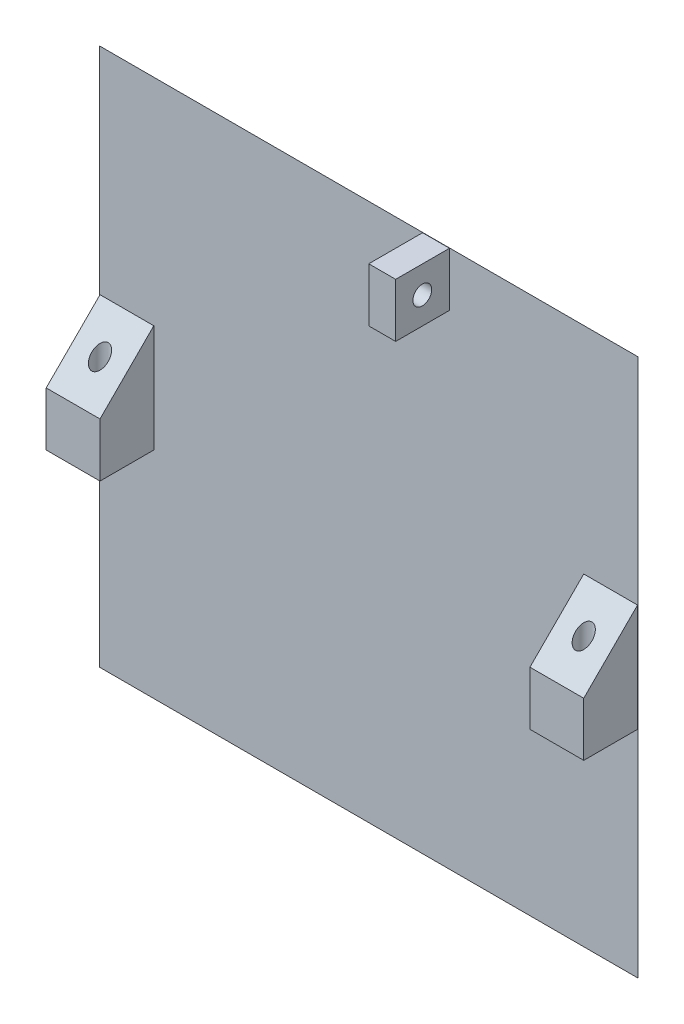
ISO-10303-21;
HEADER;
FILE_DESCRIPTION(('STEP AP214'),'2;1');
FILE_NAME('part.step','',(''),(''),'','','');
FILE_SCHEMA(('AUTOMOTIVE_DESIGN { 1 0 10303 214 1 1 1 1 }'));
ENDSEC;
DATA;
#1=APPLICATION_CONTEXT('core data for automotive mechanical design processes');
#2=APPLICATION_PROTOCOL_DEFINITION('international standard','automotive_design',2000,#1);
#3=PRODUCT_CONTEXT('',#1,'mechanical');
#4=PRODUCT('Part','Part','',(#3));
#5=PRODUCT_RELATED_PRODUCT_CATEGORY('part','',(#4));
#6=PRODUCT_DEFINITION_FORMATION('','',#4);
#7=PRODUCT_DEFINITION_CONTEXT('part definition',#1,'design');
#8=PRODUCT_DEFINITION('design','',#6,#7);
#9=PRODUCT_DEFINITION_SHAPE('','',#8);
#10=(LENGTH_UNIT() NAMED_UNIT(*) SI_UNIT(.MILLI.,.METRE.));
#11=(NAMED_UNIT(*) PLANE_ANGLE_UNIT() SI_UNIT($,.RADIAN.));
#12=(NAMED_UNIT(*) SI_UNIT($,.STERADIAN.) SOLID_ANGLE_UNIT());
#13=UNCERTAINTY_MEASURE_WITH_UNIT(LENGTH_MEASURE(1.E-05),#10,'distance_accuracy_value','');
#14=(GEOMETRIC_REPRESENTATION_CONTEXT(3) GLOBAL_UNCERTAINTY_ASSIGNED_CONTEXT((#13)) GLOBAL_UNIT_ASSIGNED_CONTEXT((#10,
#11,#12)) REPRESENTATION_CONTEXT('',''));
#15=CARTESIAN_POINT('',(0.,0.,0.));
#16=DIRECTION('',(0.,0.,1.));
#17=DIRECTION('',(1.,0.,0.));
#18=AXIS2_PLACEMENT_3D('',#15,#16,#17);
#19=CARTESIAN_POINT('',(0.,0.,3.));
#20=DIRECTION('',(0.,0.,1.));
#21=DIRECTION('',(1.,0.,0.));
#22=AXIS2_PLACEMENT_3D('',#19,#20,#21);
#23=PLANE('',#22);
#24=DIRECTION('',(1.,0.,0.));
#25=VECTOR('',#24,1.);
#26=CARTESIAN_POINT('',(89.95,40.,3.));
#27=LINE('',#26,#25);
#28=CARTESIAN_POINT('',(89.95,40.,3.));
#29=VERTEX_POINT('',#28);
#30=CARTESIAN_POINT('',(99.95,40.,3.));
#31=VERTEX_POINT('',#30);
#32=EDGE_CURVE('E202',#29,#31,#27,.T.);
#33=ORIENTED_EDGE('',*,*,#32,.F.);
#34=DIRECTION('',(0.,-1.,0.));
#35=VECTOR('',#34,1.);
#36=CARTESIAN_POINT('',(89.95,60.,3.));
#37=LINE('',#36,#35);
#38=CARTESIAN_POINT('',(89.95,60.,3.));
#39=VERTEX_POINT('',#38);
#40=EDGE_CURVE('E199',#39,#29,#37,.T.);
#41=ORIENTED_EDGE('',*,*,#40,.F.);
#42=DIRECTION('',(-1.,0.,0.));
#43=VECTOR('',#42,1.);
#44=CARTESIAN_POINT('',(89.95,60.,3.));
#45=LINE('',#44,#43);
#46=CARTESIAN_POINT('',(99.95,60.,3.));
#47=VERTEX_POINT('',#46);
#48=EDGE_CURVE('E193',#47,#39,#45,.T.);
#49=ORIENTED_EDGE('',*,*,#48,.F.);
#50=DIRECTION('',(0.,1.,0.));
#51=VECTOR('',#50,1.);
#52=CARTESIAN_POINT('',(99.95,60.,3.));
#53=LINE('',#52,#51);
#54=EDGE_CURVE('E204',#31,#47,#53,.T.);
#55=ORIENTED_EDGE('',*,*,#54,.F.);
#56=EDGE_LOOP('',(#33,#41,#49,#55));
#57=FACE_BOUND('',#56,.T.);
#58=DIRECTION('',(0.,-1.,0.));
#59=VECTOR('',#58,1.);
#60=CARTESIAN_POINT('',(0.,100.,3.));
#61=LINE('',#60,#59);
#62=CARTESIAN_POINT('',(0.,100.,3.));
#63=VERTEX_POINT('',#62);
#64=CARTESIAN_POINT('',(0.,0.,3.));
#65=VERTEX_POINT('',#64);
#66=EDGE_CURVE('E234',#63,#65,#61,.T.);
#67=ORIENTED_EDGE('',*,*,#66,.T.);
#68=DIRECTION('',(1.,0.,0.));
#69=VECTOR('',#68,1.);
#70=CARTESIAN_POINT('',(0.,0.,3.));
#71=LINE('',#70,#69);
#72=CARTESIAN_POINT('',(100.,0.,3.));
#73=VERTEX_POINT('',#72);
#74=EDGE_CURVE('E236',#65,#73,#71,.T.);
#75=ORIENTED_EDGE('',*,*,#74,.T.);
#76=DIRECTION('',(0.,1.,0.));
#77=VECTOR('',#76,1.);
#78=CARTESIAN_POINT('',(100.,100.,3.));
#79=LINE('',#78,#77);
#80=CARTESIAN_POINT('',(100.,100.,3.));
#81=VERTEX_POINT('',#80);
#82=EDGE_CURVE('E239',#73,#81,#79,.T.);
#83=ORIENTED_EDGE('',*,*,#82,.T.);
#84=DIRECTION('',(-1.,0.,0.));
#85=VECTOR('',#84,1.);
#86=CARTESIAN_POINT('',(0.,100.,3.));
#87=LINE('',#86,#85);
#88=EDGE_CURVE('E241',#81,#63,#87,.T.);
#89=ORIENTED_EDGE('',*,*,#88,.T.);
#90=EDGE_LOOP('',(#67,#75,#83,#89));
#91=FACE_BOUND('',#90,.T.);
#92=DIRECTION('',(1.,0.,0.));
#93=VECTOR('',#92,1.);
#94=CARTESIAN_POINT('',(0.0499999999999819,40.,3.));
#95=LINE('',#94,#93);
#96=CARTESIAN_POINT('',(0.0499999999999819,40.,3.));
#97=VERTEX_POINT('',#96);
#98=CARTESIAN_POINT('',(10.05,40.,3.));
#99=VERTEX_POINT('',#98);
#100=EDGE_CURVE('E224',#97,#99,#95,.T.);
#101=ORIENTED_EDGE('',*,*,#100,.F.);
#102=DIRECTION('',(0.,-1.,0.));
#103=VECTOR('',#102,1.);
#104=CARTESIAN_POINT('',(0.0499999999999793,60.,3.));
#105=LINE('',#104,#103);
#106=CARTESIAN_POINT('',(0.0499999999999793,60.,3.));
#107=VERTEX_POINT('',#106);
#108=EDGE_CURVE('E212',#107,#97,#105,.T.);
#109=ORIENTED_EDGE('',*,*,#108,.F.);
#110=DIRECTION('',(-1.,0.,0.));
#111=VECTOR('',#110,1.);
#112=CARTESIAN_POINT('',(0.0499999999999793,60.,3.));
#113=LINE('',#112,#111);
#114=CARTESIAN_POINT('',(10.05,60.,3.));
#115=VERTEX_POINT('',#114);
#116=EDGE_CURVE('E216',#115,#107,#113,.T.);
#117=ORIENTED_EDGE('',*,*,#116,.F.);
#118=DIRECTION('',(0.,1.,0.));
#119=VECTOR('',#118,1.);
#120=CARTESIAN_POINT('',(10.05,60.,3.));
#121=LINE('',#120,#119);
#122=EDGE_CURVE('E226',#99,#115,#121,.T.);
#123=ORIENTED_EDGE('',*,*,#122,.F.);
#124=EDGE_LOOP('',(#101,#109,#117,#123));
#125=FACE_BOUND('',#124,.T.);
#126=DIRECTION('',(-1.,0.,0.));
#127=VECTOR('',#126,1.);
#128=CARTESIAN_POINT('',(65.,99.95,3.));
#129=LINE('',#128,#127);
#130=CARTESIAN_POINT('',(65.,99.95,3.));
#131=VERTEX_POINT('',#130);
#132=CARTESIAN_POINT('',(60.,99.95,3.));
#133=VERTEX_POINT('',#132);
#134=EDGE_CURVE('E298',#131,#133,#129,.T.);
#135=ORIENTED_EDGE('',*,*,#134,.F.);
#136=DIRECTION('',(0.,1.,0.));
#137=VECTOR('',#136,1.);
#138=CARTESIAN_POINT('',(65.,99.95,3.));
#139=LINE('',#138,#137);
#140=CARTESIAN_POINT('',(65.,89.95,3.));
#141=VERTEX_POINT('',#140);
#142=EDGE_CURVE('E172',#141,#131,#139,.T.);
#143=ORIENTED_EDGE('',*,*,#142,.F.);
#144=DIRECTION('',(1.,0.,0.));
#145=VECTOR('',#144,1.);
#146=CARTESIAN_POINT('',(65.,89.95,3.));
#147=LINE('',#146,#145);
#148=CARTESIAN_POINT('',(60.,89.95,3.));
#149=VERTEX_POINT('',#148);
#150=EDGE_CURVE('E168',#149,#141,#147,.T.);
#151=ORIENTED_EDGE('',*,*,#150,.F.);
#152=DIRECTION('',(0.,-1.,0.));
#153=VECTOR('',#152,1.);
#154=CARTESIAN_POINT('',(60.,99.95,3.));
#155=LINE('',#154,#153);
#156=EDGE_CURVE('E300',#133,#149,#155,.T.);
#157=ORIENTED_EDGE('',*,*,#156,.F.);
#158=EDGE_LOOP('',(#135,#143,#151,#157));
#159=FACE_BOUND('',#158,.T.);
#160=ADVANCED_FACE('F35',(#57,#91,#125,#159),#23,.T.);
#161=CARTESIAN_POINT('',(0.,0.,0.));
#162=DIRECTION('',(0.,0.,1.));
#163=DIRECTION('',(1.,0.,0.));
#164=AXIS2_PLACEMENT_3D('',#161,#162,#163);
#165=PLANE('',#164);
#166=DIRECTION('',(0.,-1.,0.));
#167=VECTOR('',#166,1.);
#168=CARTESIAN_POINT('',(97.,0.,0.));
#169=LINE('',#168,#167);
#170=CARTESIAN_POINT('',(97.,97.,0.));
#171=VERTEX_POINT('',#170);
#172=CARTESIAN_POINT('',(97.,3.00000000000002,0.));
#173=VERTEX_POINT('',#172);
#174=EDGE_CURVE('E44',#171,#173,#169,.T.);
#175=ORIENTED_EDGE('',*,*,#174,.T.);
#176=DIRECTION('',(-1.,0.,0.));
#177=VECTOR('',#176,1.);
#178=CARTESIAN_POINT('',(0.,3.00000000000002,0.));
#179=LINE('',#178,#177);
#180=CARTESIAN_POINT('',(3.00000000000002,3.00000000000002,0.));
#181=VERTEX_POINT('',#180);
#182=EDGE_CURVE('E11',#173,#181,#179,.T.);
#183=ORIENTED_EDGE('',*,*,#182,.T.);
#184=DIRECTION('',(0.,1.,0.));
#185=VECTOR('',#184,1.);
#186=CARTESIAN_POINT('',(3.00000000000002,0.,0.));
#187=LINE('',#186,#185);
#188=CARTESIAN_POINT('',(3.,97.,0.));
#189=VERTEX_POINT('',#188);
#190=EDGE_CURVE('E257',#181,#189,#187,.T.);
#191=ORIENTED_EDGE('',*,*,#190,.T.);
#192=DIRECTION('',(1.,0.,0.));
#193=VECTOR('',#192,1.);
#194=CARTESIAN_POINT('',(0.,97.,0.));
#195=LINE('',#194,#193);
#196=EDGE_CURVE('E263',#189,#171,#195,.T.);
#197=ORIENTED_EDGE('',*,*,#196,.T.);
#198=EDGE_LOOP('',(#175,#183,#191,#197));
#199=FACE_BOUND('',#198,.T.);
#200=ADVANCED_FACE('F280',(#199),#165,.F.);
#201=CARTESIAN_POINT('',(0.0499999999999793,60.,13.));
#202=DIRECTION('',(1.,0.,0.));
#203=DIRECTION('',(0.,1.,0.));
#204=AXIS2_PLACEMENT_3D('',#201,#202,#203);
#205=PLANE('',#204);
#206=DIRECTION('',(0.,-1.,0.));
#207=VECTOR('',#206,1.);
#208=CARTESIAN_POINT('',(0.0499999999999793,60.,13.));
#209=LINE('',#208,#207);
#210=CARTESIAN_POINT('',(0.0499999999999806,50.,13.));
#211=VERTEX_POINT('',#210);
#212=CARTESIAN_POINT('',(0.0499999999999819,40.,13.));
#213=VERTEX_POINT('',#212);
#214=EDGE_CURVE('E213',#211,#213,#209,.T.);
#215=ORIENTED_EDGE('',*,*,#214,.F.);
#216=DIRECTION('',(0.,0.707106781186547,-0.707106781186549));
#217=VECTOR('',#216,1.);
#218=CARTESIAN_POINT('',(0.0499999999999806,50.,13.));
#219=LINE('',#218,#217);
#220=EDGE_CURVE('E253',#211,#107,#219,.T.);
#221=ORIENTED_EDGE('',*,*,#220,.T.);
#222=ORIENTED_EDGE('',*,*,#108,.T.);
#223=DIRECTION('',(0.,0.,-1.));
#224=VECTOR('',#223,1.);
#225=CARTESIAN_POINT('',(0.0499999999999819,40.,13.));
#226=LINE('',#225,#224);
#227=EDGE_CURVE('E232',#213,#97,#226,.T.);
#228=ORIENTED_EDGE('',*,*,#227,.F.);
#229=EDGE_LOOP('',(#215,#221,#222,#228));
#230=FACE_BOUND('',#229,.T.);
#231=ADVANCED_FACE('F375',(#230),#205,.F.);
#232=CARTESIAN_POINT('',(0.0499999999999819,40.,13.));
#233=DIRECTION('',(0.,1.,0.));
#234=DIRECTION('',(0.,0.,1.));
#235=AXIS2_PLACEMENT_3D('',#232,#233,#234);
#236=PLANE('',#235);
#237=CARTESIAN_POINT('',(5.04622786455411,40.,8.));
#238=DIRECTION('',(0.,-1.,0.));
#239=DIRECTION('',(0.,0.,-1.));
#240=AXIS2_PLACEMENT_3D('',#237,#238,#239);
#241=CIRCLE('',#240,1.525);
#242=CARTESIAN_POINT('',(5.04622786455411,40.,6.475));
#243=VERTEX_POINT('',#242);
#244=EDGE_CURVE('E186',#243,#243,#241,.T.);
#245=ORIENTED_EDGE('',*,*,#244,.F.);
#246=EDGE_LOOP('',(#245));
#247=FACE_BOUND('',#246,.T.);
#248=ORIENTED_EDGE('',*,*,#100,.T.);
#249=DIRECTION('',(0.,0.,-1.));
#250=VECTOR('',#249,1.);
#251=CARTESIAN_POINT('',(10.05,40.,13.));
#252=LINE('',#251,#250);
#253=CARTESIAN_POINT('',(10.05,40.,13.));
#254=VERTEX_POINT('',#253);
#255=EDGE_CURVE('E221',#254,#99,#252,.T.);
#256=ORIENTED_EDGE('',*,*,#255,.F.);
#257=DIRECTION('',(1.,0.,0.));
#258=VECTOR('',#257,1.);
#259=CARTESIAN_POINT('',(0.0499999999999819,40.,13.));
#260=LINE('',#259,#258);
#261=EDGE_CURVE('E215',#213,#254,#260,.T.);
#262=ORIENTED_EDGE('',*,*,#261,.F.);
#263=ORIENTED_EDGE('',*,*,#227,.T.);
#264=EDGE_LOOP('',(#248,#256,#262,#263));
#265=FACE_BOUND('',#264,.T.);
#266=ADVANCED_FACE('F371',(#247,#265),#236,.F.);
#267=CARTESIAN_POINT('',(10.05,60.,13.));
#268=DIRECTION('',(-1.,0.,0.));
#269=DIRECTION('',(0.,0.,1.));
#270=AXIS2_PLACEMENT_3D('',#267,#268,#269);
#271=PLANE('',#270);
#272=ORIENTED_EDGE('',*,*,#122,.T.);
#273=DIRECTION('',(0.,-0.707106781186547,0.707106781186549));
#274=VECTOR('',#273,1.);
#275=CARTESIAN_POINT('',(10.05,50.,13.));
#276=LINE('',#275,#274);
#277=CARTESIAN_POINT('',(10.05,50.,13.));
#278=VERTEX_POINT('',#277);
#279=EDGE_CURVE('E255',#115,#278,#276,.T.);
#280=ORIENTED_EDGE('',*,*,#279,.T.);
#281=DIRECTION('',(0.,1.,0.));
#282=VECTOR('',#281,1.);
#283=CARTESIAN_POINT('',(10.05,60.,13.));
#284=LINE('',#283,#282);
#285=EDGE_CURVE('E218',#254,#278,#284,.T.);
#286=ORIENTED_EDGE('',*,*,#285,.F.);
#287=ORIENTED_EDGE('',*,*,#255,.T.);
#288=EDGE_LOOP('',(#272,#280,#286,#287));
#289=FACE_BOUND('',#288,.T.);
#290=ADVANCED_FACE('F367',(#289),#271,.F.);
#291=CARTESIAN_POINT('',(0.,0.,13.));
#292=DIRECTION('',(0.,0.,1.));
#293=DIRECTION('',(1.,0.,0.));
#294=AXIS2_PLACEMENT_3D('',#291,#292,#293);
#295=PLANE('',#294);
#296=ORIENTED_EDGE('',*,*,#285,.T.);
#297=DIRECTION('',(-1.,0.,0.));
#298=VECTOR('',#297,1.);
#299=CARTESIAN_POINT('',(0.0499999999999793,50.,13.));
#300=LINE('',#299,#298);
#301=EDGE_CURVE('E250',#278,#211,#300,.T.);
#302=ORIENTED_EDGE('',*,*,#301,.T.);
#303=ORIENTED_EDGE('',*,*,#214,.T.);
#304=ORIENTED_EDGE('',*,*,#261,.T.);
#305=EDGE_LOOP('',(#296,#302,#303,#304));
#306=FACE_BOUND('',#305,.T.);
#307=ADVANCED_FACE('F363',(#306),#295,.T.);
#308=CARTESIAN_POINT('',(89.95,60.,13.));
#309=DIRECTION('',(1.,0.,0.));
#310=DIRECTION('',(0.,1.,0.));
#311=AXIS2_PLACEMENT_3D('',#308,#309,#310);
#312=PLANE('',#311);
#313=DIRECTION('',(0.,-1.,0.));
#314=VECTOR('',#313,1.);
#315=CARTESIAN_POINT('',(89.95,60.,13.));
#316=LINE('',#315,#314);
#317=CARTESIAN_POINT('',(89.95,50.,13.));
#318=VERTEX_POINT('',#317);
#319=CARTESIAN_POINT('',(89.95,40.,13.));
#320=VERTEX_POINT('',#319);
#321=EDGE_CURVE('E190',#318,#320,#316,.T.);
#322=ORIENTED_EDGE('',*,*,#321,.F.);
#323=DIRECTION('',(0.,0.707106781186547,-0.707106781186549));
#324=VECTOR('',#323,1.);
#325=CARTESIAN_POINT('',(89.95,50.,13.));
#326=LINE('',#325,#324);
#327=EDGE_CURVE('E246',#318,#39,#326,.T.);
#328=ORIENTED_EDGE('',*,*,#327,.T.);
#329=ORIENTED_EDGE('',*,*,#40,.T.);
#330=DIRECTION('',(0.,0.,-1.));
#331=VECTOR('',#330,1.);
#332=CARTESIAN_POINT('',(89.95,40.,13.));
#333=LINE('',#332,#331);
#334=EDGE_CURVE('E210',#320,#29,#333,.T.);
#335=ORIENTED_EDGE('',*,*,#334,.F.);
#336=EDGE_LOOP('',(#322,#328,#329,#335));
#337=FACE_BOUND('',#336,.T.);
#338=ADVANCED_FACE('F359',(#337),#312,.F.);
#339=CARTESIAN_POINT('',(89.95,40.,13.));
#340=DIRECTION('',(0.,1.,0.));
#341=DIRECTION('',(0.,0.,1.));
#342=AXIS2_PLACEMENT_3D('',#339,#340,#341);
#343=PLANE('',#342);
#344=CARTESIAN_POINT('',(94.95,40.,8.));
#345=DIRECTION('',(0.,-1.,0.));
#346=DIRECTION('',(0.,0.,-1.));
#347=AXIS2_PLACEMENT_3D('',#344,#345,#346);
#348=CIRCLE('',#347,1.525);
#349=CARTESIAN_POINT('',(94.95,40.,6.475));
#350=VERTEX_POINT('',#349);
#351=EDGE_CURVE('E181',#350,#350,#348,.T.);
#352=ORIENTED_EDGE('',*,*,#351,.F.);
#353=EDGE_LOOP('',(#352));
#354=FACE_BOUND('',#353,.T.);
#355=ORIENTED_EDGE('',*,*,#32,.T.);
#356=DIRECTION('',(0.,0.,-1.));
#357=VECTOR('',#356,1.);
#358=CARTESIAN_POINT('',(99.95,40.,13.));
#359=LINE('',#358,#357);
#360=CARTESIAN_POINT('',(99.95,40.,13.));
#361=VERTEX_POINT('',#360);
#362=EDGE_CURVE('E198',#361,#31,#359,.T.);
#363=ORIENTED_EDGE('',*,*,#362,.F.);
#364=DIRECTION('',(1.,0.,0.));
#365=VECTOR('',#364,1.);
#366=CARTESIAN_POINT('',(89.95,40.,13.));
#367=LINE('',#366,#365);
#368=EDGE_CURVE('E192',#320,#361,#367,.T.);
#369=ORIENTED_EDGE('',*,*,#368,.F.);
#370=ORIENTED_EDGE('',*,*,#334,.T.);
#371=EDGE_LOOP('',(#355,#363,#369,#370));
#372=FACE_BOUND('',#371,.T.);
#373=ADVANCED_FACE('F355',(#354,#372),#343,.F.);
#374=CARTESIAN_POINT('',(99.95,60.,13.));
#375=DIRECTION('',(-1.,0.,0.));
#376=DIRECTION('',(0.,0.,1.));
#377=AXIS2_PLACEMENT_3D('',#374,#375,#376);
#378=PLANE('',#377);
#379=ORIENTED_EDGE('',*,*,#54,.T.);
#380=DIRECTION('',(0.,-0.707106781186547,0.707106781186549));
#381=VECTOR('',#380,1.);
#382=CARTESIAN_POINT('',(99.95,50.,13.));
#383=LINE('',#382,#381);
#384=CARTESIAN_POINT('',(99.95,50.,13.));
#385=VERTEX_POINT('',#384);
#386=EDGE_CURVE('E248',#47,#385,#383,.T.);
#387=ORIENTED_EDGE('',*,*,#386,.T.);
#388=DIRECTION('',(0.,1.,0.));
#389=VECTOR('',#388,1.);
#390=CARTESIAN_POINT('',(99.95,60.,13.));
#391=LINE('',#390,#389);
#392=EDGE_CURVE('E195',#361,#385,#391,.T.);
#393=ORIENTED_EDGE('',*,*,#392,.F.);
#394=ORIENTED_EDGE('',*,*,#362,.T.);
#395=EDGE_LOOP('',(#379,#387,#393,#394));
#396=FACE_BOUND('',#395,.T.);
#397=ADVANCED_FACE('F351',(#396),#378,.F.);
#398=CARTESIAN_POINT('',(0.,0.,13.));
#399=DIRECTION('',(0.,0.,1.));
#400=DIRECTION('',(1.,0.,0.));
#401=AXIS2_PLACEMENT_3D('',#398,#399,#400);
#402=PLANE('',#401);
#403=ORIENTED_EDGE('',*,*,#392,.T.);
#404=DIRECTION('',(-1.,0.,0.));
#405=VECTOR('',#404,1.);
#406=CARTESIAN_POINT('',(89.95,50.,13.));
#407=LINE('',#406,#405);
#408=EDGE_CURVE('E243',#385,#318,#407,.T.);
#409=ORIENTED_EDGE('',*,*,#408,.T.);
#410=ORIENTED_EDGE('',*,*,#321,.T.);
#411=ORIENTED_EDGE('',*,*,#368,.T.);
#412=EDGE_LOOP('',(#403,#409,#410,#411));
#413=FACE_BOUND('',#412,.T.);
#414=ADVANCED_FACE('F347',(#413),#402,.T.);
#415=CARTESIAN_POINT('',(0.,50.,13.));
#416=DIRECTION('',(0.,0.707106781186548,0.707106781186546));
#417=DIRECTION('',(1.,0.,0.));
#418=AXIS2_PLACEMENT_3D('',#415,#416,#417);
#419=PLANE('',#418);
#420=CARTESIAN_POINT('',(94.95,55.,8.));
#421=DIRECTION('',(0.,0.707106781186548,0.707106781186546));
#422=DIRECTION('',(0.,-0.707106781186547,0.707106781186549));
#423=AXIS2_PLACEMENT_3D('',#420,#421,#422);
#424=ELLIPSE('',#423,2.15667568261896,1.525);
#425=CARTESIAN_POINT('',(94.95,53.475,9.525));
#426=VERTEX_POINT('',#425);
#427=EDGE_CURVE('E184',#426,#426,#424,.T.);
#428=ORIENTED_EDGE('',*,*,#427,.F.);
#429=EDGE_LOOP('',(#428));
#430=FACE_BOUND('',#429,.T.);
#431=ORIENTED_EDGE('',*,*,#386,.F.);
#432=ORIENTED_EDGE('',*,*,#48,.T.);
#433=ORIENTED_EDGE('',*,*,#327,.F.);
#434=ORIENTED_EDGE('',*,*,#408,.F.);
#435=EDGE_LOOP('',(#431,#432,#433,#434));
#436=FACE_BOUND('',#435,.T.);
#437=ADVANCED_FACE('F350',(#430,#436),#419,.T.);
#438=CARTESIAN_POINT('',(0.,50.,13.));
#439=DIRECTION('',(0.,0.707106781186548,0.707106781186546));
#440=DIRECTION('',(1.,0.,0.));
#441=AXIS2_PLACEMENT_3D('',#438,#439,#440);
#442=PLANE('',#441);
#443=CARTESIAN_POINT('',(5.04622786455411,55.,8.));
#444=DIRECTION('',(0.,0.707106781186548,0.707106781186546));
#445=DIRECTION('',(0.,-0.707106781186547,0.707106781186549));
#446=AXIS2_PLACEMENT_3D('',#443,#444,#445);
#447=ELLIPSE('',#446,2.15667568261897,1.525);
#448=CARTESIAN_POINT('',(5.04622786455411,53.475,9.525));
#449=VERTEX_POINT('',#448);
#450=EDGE_CURVE('E189',#449,#449,#447,.T.);
#451=ORIENTED_EDGE('',*,*,#450,.F.);
#452=EDGE_LOOP('',(#451));
#453=FACE_BOUND('',#452,.T.);
#454=ORIENTED_EDGE('',*,*,#279,.F.);
#455=ORIENTED_EDGE('',*,*,#116,.T.);
#456=ORIENTED_EDGE('',*,*,#220,.F.);
#457=ORIENTED_EDGE('',*,*,#301,.F.);
#458=EDGE_LOOP('',(#454,#455,#456,#457));
#459=FACE_BOUND('',#458,.T.);
#460=ADVANCED_FACE('F345',(#453,#459),#442,.T.);
#461=CARTESIAN_POINT('',(5.04622786455411,100.,8.));
#462=DIRECTION('',(0.,-1.,0.));
#463=DIRECTION('',(0.,0.,-1.));
#464=AXIS2_PLACEMENT_3D('',#461,#462,#463);
#465=CYLINDRICAL_SURFACE('',#464,1.525);
#466=ORIENTED_EDGE('',*,*,#450,.T.);
#467=EDGE_LOOP('',(#466));
#468=FACE_BOUND('',#467,.T.);
#469=ORIENTED_EDGE('',*,*,#244,.T.);
#470=EDGE_LOOP('',(#469));
#471=FACE_BOUND('',#470,.T.);
#472=ADVANCED_FACE('F341',(#468,#471),#465,.F.);
#473=CARTESIAN_POINT('',(94.95,100.,8.));
#474=DIRECTION('',(0.,-1.,0.));
#475=DIRECTION('',(0.,0.,-1.));
#476=AXIS2_PLACEMENT_3D('',#473,#474,#475);
#477=CYLINDRICAL_SURFACE('',#476,1.525);
#478=ORIENTED_EDGE('',*,*,#427,.T.);
#479=EDGE_LOOP('',(#478));
#480=FACE_BOUND('',#479,.T.);
#481=ORIENTED_EDGE('',*,*,#351,.T.);
#482=EDGE_LOOP('',(#481));
#483=FACE_BOUND('',#482,.T.);
#484=ADVANCED_FACE('F338',(#480,#483),#477,.F.);
#485=CARTESIAN_POINT('',(0.,100.,3.));
#486=DIRECTION('',(0.,-0.707106781186546,0.707106781186549));
#487=DIRECTION('',(-1.,0.,0.));
#488=AXIS2_PLACEMENT_3D('',#485,#486,#487);
#489=PLANE('',#488);
#490=DIRECTION('',(-0.577350269189627,-0.577350269189627,-0.577350269189624));
#491=VECTOR('',#490,1.);
#492=CARTESIAN_POINT('',(66.6666666666666,66.6666666666666,-30.3333333333333));
#493=LINE('',#492,#491);
#494=EDGE_CURVE('E267',#171,#81,#493,.F.);
#495=ORIENTED_EDGE('',*,*,#494,.F.);
#496=ORIENTED_EDGE('',*,*,#196,.F.);
#497=DIRECTION('',(0.577350269189627,-0.577350269189627,-0.577350269189624));
#498=VECTOR('',#497,1.);
#499=CARTESIAN_POINT('',(0.,100.,3.));
#500=LINE('',#499,#498);
#501=EDGE_CURVE('E185',#63,#189,#500,.T.);
#502=ORIENTED_EDGE('',*,*,#501,.F.);
#503=ORIENTED_EDGE('',*,*,#88,.F.);
#504=EDGE_LOOP('',(#495,#496,#502,#503));
#505=FACE_BOUND('',#504,.T.);
#506=ADVANCED_FACE('F37',(#505),#489,.F.);
#507=CARTESIAN_POINT('',(0.,100.,3.));
#508=DIRECTION('',(0.707106781186546,0.,0.707106781186549));
#509=DIRECTION('',(0.,-1.,0.));
#510=AXIS2_PLACEMENT_3D('',#507,#508,#509);
#511=PLANE('',#510);
#512=ORIENTED_EDGE('',*,*,#501,.T.);
#513=ORIENTED_EDGE('',*,*,#190,.F.);
#514=DIRECTION('',(-0.577350269189627,-0.577350269189627,0.577350269189624));
#515=VECTOR('',#514,1.);
#516=CARTESIAN_POINT('',(33.3333333333334,33.3333333333334,-30.3333333333333));
#517=LINE('',#516,#515);
#518=EDGE_CURVE('E176',#65,#181,#517,.F.);
#519=ORIENTED_EDGE('',*,*,#518,.F.);
#520=ORIENTED_EDGE('',*,*,#66,.F.);
#521=EDGE_LOOP('',(#512,#513,#519,#520));
#522=FACE_BOUND('',#521,.T.);
#523=ADVANCED_FACE('F274',(#522),#511,.F.);
#524=CARTESIAN_POINT('',(100.,100.,3.));
#525=DIRECTION('',(-0.707106781186546,0.,0.707106781186549));
#526=DIRECTION('',(0.,1.,0.));
#527=AXIS2_PLACEMENT_3D('',#524,#525,#526);
#528=PLANE('',#527);
#529=ORIENTED_EDGE('',*,*,#494,.T.);
#530=ORIENTED_EDGE('',*,*,#82,.F.);
#531=DIRECTION('',(-0.577350269189627,0.577350269189627,-0.577350269189624));
#532=VECTOR('',#531,1.);
#533=CARTESIAN_POINT('',(66.6666666666666,33.3333333333334,-30.3333333333333));
#534=LINE('',#533,#532);
#535=EDGE_CURVE('E174',#173,#73,#534,.F.);
#536=ORIENTED_EDGE('',*,*,#535,.F.);
#537=ORIENTED_EDGE('',*,*,#174,.F.);
#538=EDGE_LOOP('',(#529,#530,#536,#537));
#539=FACE_BOUND('',#538,.T.);
#540=ADVANCED_FACE('F287',(#539),#528,.F.);
#541=CARTESIAN_POINT('',(0.,0.,3.));
#542=DIRECTION('',(0.,0.707106781186546,0.707106781186549));
#543=DIRECTION('',(1.,0.,0.));
#544=AXIS2_PLACEMENT_3D('',#541,#542,#543);
#545=PLANE('',#544);
#546=ORIENTED_EDGE('',*,*,#518,.T.);
#547=ORIENTED_EDGE('',*,*,#182,.F.);
#548=ORIENTED_EDGE('',*,*,#535,.T.);
#549=ORIENTED_EDGE('',*,*,#74,.F.);
#550=EDGE_LOOP('',(#546,#547,#548,#549));
#551=FACE_BOUND('',#550,.T.);
#552=ADVANCED_FACE('F283',(#551),#545,.F.);
#553=CARTESIAN_POINT('',(65.,99.95,13.));
#554=DIRECTION('',(-1.,0.,0.));
#555=DIRECTION('',(0.,0.,1.));
#556=AXIS2_PLACEMENT_3D('',#553,#554,#555);
#557=PLANE('',#556);
#558=CARTESIAN_POINT('',(65.,94.95,8.05));
#559=DIRECTION('',(1.,0.,0.));
#560=DIRECTION('',(0.,0.,-1.));
#561=AXIS2_PLACEMENT_3D('',#558,#559,#560);
#562=CIRCLE('',#561,1.75);
#563=CARTESIAN_POINT('',(65.,94.95,6.3));
#564=VERTEX_POINT('',#563);
#565=EDGE_CURVE('E310',#564,#564,#562,.T.);
#566=ORIENTED_EDGE('',*,*,#565,.F.);
#567=EDGE_LOOP('',(#566));
#568=FACE_BOUND('',#567,.T.);
#569=ORIENTED_EDGE('',*,*,#142,.T.);
#570=DIRECTION('',(0.,0.,-1.));
#571=VECTOR('',#570,1.);
#572=CARTESIAN_POINT('',(65.,99.95,13.));
#573=LINE('',#572,#571);
#574=CARTESIAN_POINT('',(65.,99.95,13.));
#575=VERTEX_POINT('',#574);
#576=EDGE_CURVE('E153',#575,#131,#573,.T.);
#577=ORIENTED_EDGE('',*,*,#576,.F.);
#578=DIRECTION('',(0.,1.,0.));
#579=VECTOR('',#578,1.);
#580=CARTESIAN_POINT('',(65.,99.95,13.));
#581=LINE('',#580,#579);
#582=CARTESIAN_POINT('',(65.,89.95,13.));
#583=VERTEX_POINT('',#582);
#584=EDGE_CURVE('E160',#583,#575,#581,.T.);
#585=ORIENTED_EDGE('',*,*,#584,.F.);
#586=DIRECTION('',(0.,0.,-1.));
#587=VECTOR('',#586,1.);
#588=CARTESIAN_POINT('',(65.,89.95,13.));
#589=LINE('',#588,#587);
#590=EDGE_CURVE('E307',#583,#141,#589,.T.);
#591=ORIENTED_EDGE('',*,*,#590,.T.);
#592=EDGE_LOOP('',(#569,#577,#585,#591));
#593=FACE_BOUND('',#592,.T.);
#594=ADVANCED_FACE('F170',(#568,#593),#557,.F.);
#595=CARTESIAN_POINT('',(65.,99.95,13.));
#596=DIRECTION('',(0.,-1.,0.));
#597=DIRECTION('',(0.,0.,-1.));
#598=AXIS2_PLACEMENT_3D('',#595,#596,#597);
#599=PLANE('',#598);
#600=ORIENTED_EDGE('',*,*,#134,.T.);
#601=DIRECTION('',(0.,0.,-1.));
#602=VECTOR('',#601,1.);
#603=CARTESIAN_POINT('',(60.,99.95,13.));
#604=LINE('',#603,#602);
#605=CARTESIAN_POINT('',(60.,99.95,13.));
#606=VERTEX_POINT('',#605);
#607=EDGE_CURVE('E156',#606,#133,#604,.T.);
#608=ORIENTED_EDGE('',*,*,#607,.F.);
#609=DIRECTION('',(-1.,0.,0.));
#610=VECTOR('',#609,1.);
#611=CARTESIAN_POINT('',(65.,99.95,13.));
#612=LINE('',#611,#610);
#613=EDGE_CURVE('E149',#575,#606,#612,.T.);
#614=ORIENTED_EDGE('',*,*,#613,.F.);
#615=ORIENTED_EDGE('',*,*,#576,.T.);
#616=EDGE_LOOP('',(#600,#608,#614,#615));
#617=FACE_BOUND('',#616,.T.);
#618=ADVANCED_FACE('F151',(#617),#599,.F.);
#619=CARTESIAN_POINT('',(60.,99.95,13.));
#620=DIRECTION('',(1.,0.,0.));
#621=DIRECTION('',(0.,1.,0.));
#622=AXIS2_PLACEMENT_3D('',#619,#620,#621);
#623=PLANE('',#622);
#624=CARTESIAN_POINT('',(60.,94.95,8.05));
#625=DIRECTION('',(1.,0.,0.));
#626=DIRECTION('',(0.,1.,0.));
#627=AXIS2_PLACEMENT_3D('',#624,#625,#626);
#628=CIRCLE('',#627,1.75);
#629=CARTESIAN_POINT('',(60.,96.7,8.05));
#630=VERTEX_POINT('',#629);
#631=EDGE_CURVE('E39',#630,#630,#628,.T.);
#632=ORIENTED_EDGE('',*,*,#631,.T.);
#633=EDGE_LOOP('',(#632));
#634=FACE_BOUND('',#633,.T.);
#635=ORIENTED_EDGE('',*,*,#156,.T.);
#636=DIRECTION('',(0.,0.,-1.));
#637=VECTOR('',#636,1.);
#638=CARTESIAN_POINT('',(60.,89.95,13.));
#639=LINE('',#638,#637);
#640=CARTESIAN_POINT('',(60.,89.95,13.));
#641=VERTEX_POINT('',#640);
#642=EDGE_CURVE('E52',#641,#149,#639,.T.);
#643=ORIENTED_EDGE('',*,*,#642,.F.);
#644=DIRECTION('',(0.,-1.,0.));
#645=VECTOR('',#644,1.);
#646=CARTESIAN_POINT('',(60.,99.95,13.));
#647=LINE('',#646,#645);
#648=EDGE_CURVE('E159',#606,#641,#647,.T.);
#649=ORIENTED_EDGE('',*,*,#648,.F.);
#650=ORIENTED_EDGE('',*,*,#607,.T.);
#651=EDGE_LOOP('',(#635,#643,#649,#650));
#652=FACE_BOUND('',#651,.T.);
#653=ADVANCED_FACE('F317',(#634,#652),#623,.F.);
#654=CARTESIAN_POINT('',(65.,89.95,13.));
#655=DIRECTION('',(0.,1.,0.));
#656=DIRECTION('',(-1.,0.,0.));
#657=AXIS2_PLACEMENT_3D('',#654,#655,#656);
#658=PLANE('',#657);
#659=ORIENTED_EDGE('',*,*,#150,.T.);
#660=ORIENTED_EDGE('',*,*,#590,.F.);
#661=DIRECTION('',(1.,0.,0.));
#662=VECTOR('',#661,1.);
#663=CARTESIAN_POINT('',(65.,89.95,13.));
#664=LINE('',#663,#662);
#665=EDGE_CURVE('E164',#641,#583,#664,.T.);
#666=ORIENTED_EDGE('',*,*,#665,.F.);
#667=ORIENTED_EDGE('',*,*,#642,.T.);
#668=EDGE_LOOP('',(#659,#660,#666,#667));
#669=FACE_BOUND('',#668,.T.);
#670=ADVANCED_FACE('F326',(#669),#658,.F.);
#671=CARTESIAN_POINT('',(0.,0.,13.));
#672=DIRECTION('',(0.,0.,-1.));
#673=DIRECTION('',(-1.,0.,0.));
#674=AXIS2_PLACEMENT_3D('',#671,#672,#673);
#675=PLANE('',#674);
#676=ORIENTED_EDGE('',*,*,#584,.T.);
#677=ORIENTED_EDGE('',*,*,#613,.T.);
#678=ORIENTED_EDGE('',*,*,#648,.T.);
#679=ORIENTED_EDGE('',*,*,#665,.T.);
#680=EDGE_LOOP('',(#676,#677,#678,#679));
#681=FACE_BOUND('',#680,.T.);
#682=ADVANCED_FACE('F163',(#681),#675,.F.);
#683=CARTESIAN_POINT('',(55.,94.95,8.05));
#684=DIRECTION('',(1.,0.,0.));
#685=DIRECTION('',(0.,0.,-1.));
#686=AXIS2_PLACEMENT_3D('',#683,#684,#685);
#687=CYLINDRICAL_SURFACE('',#686,1.75);
#688=ORIENTED_EDGE('',*,*,#565,.T.);
#689=EDGE_LOOP('',(#688));
#690=FACE_BOUND('',#689,.T.);
#691=ORIENTED_EDGE('',*,*,#631,.F.);
#692=EDGE_LOOP('',(#691));
#693=FACE_BOUND('',#692,.T.);
#694=ADVANCED_FACE('F320',(#690,#693),#687,.F.);
#695=CLOSED_SHELL('',(#160,#200,#231,#266,#290,#307,#338,#373,#397,#414,#437,#460,#472,#484,
#506,#523,#540,#552,#594,#618,#653,#670,#682,#694));
#696=MANIFOLD_SOLID_BREP('B2',#695);
#697=ADVANCED_BREP_SHAPE_REPRESENTATION('',(#18,#696),#14);
#698=SHAPE_DEFINITION_REPRESENTATION(#9,#697);
ENDSEC;
END-ISO-10303-21;
